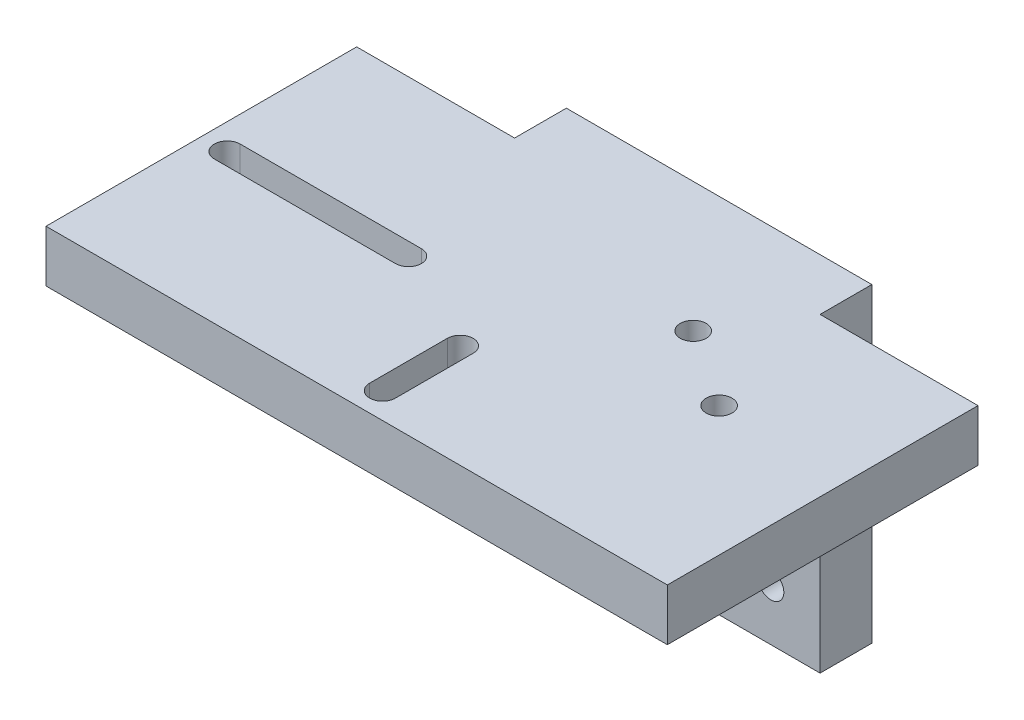
ISO-10303-21;
HEADER;
FILE_DESCRIPTION(('STEP AP214'),'2;1');
FILE_NAME('part.step','',(''),(''),'','','');
FILE_SCHEMA(('AUTOMOTIVE_DESIGN { 1 0 10303 214 1 1 1 1 }'));
ENDSEC;
DATA;
#1=APPLICATION_CONTEXT('core data for automotive mechanical design processes');
#2=APPLICATION_PROTOCOL_DEFINITION('international standard','automotive_design',2000,#1);
#3=PRODUCT_CONTEXT('',#1,'mechanical');
#4=PRODUCT('Part','Part','',(#3));
#5=PRODUCT_RELATED_PRODUCT_CATEGORY('part','',(#4));
#6=PRODUCT_DEFINITION_FORMATION('','',#4);
#7=PRODUCT_DEFINITION_CONTEXT('part definition',#1,'design');
#8=PRODUCT_DEFINITION('design','',#6,#7);
#9=PRODUCT_DEFINITION_SHAPE('','',#8);
#10=(LENGTH_UNIT() NAMED_UNIT(*) SI_UNIT(.MILLI.,.METRE.));
#11=(NAMED_UNIT(*) PLANE_ANGLE_UNIT() SI_UNIT($,.RADIAN.));
#12=(NAMED_UNIT(*) SI_UNIT($,.STERADIAN.) SOLID_ANGLE_UNIT());
#13=UNCERTAINTY_MEASURE_WITH_UNIT(LENGTH_MEASURE(1.E-05),#10,'distance_accuracy_value','');
#14=(GEOMETRIC_REPRESENTATION_CONTEXT(3) GLOBAL_UNCERTAINTY_ASSIGNED_CONTEXT((#13)) GLOBAL_UNIT_ASSIGNED_CONTEXT((#10,
#11,#12)) REPRESENTATION_CONTEXT('',''));
#15=CARTESIAN_POINT('',(0.,0.,0.));
#16=DIRECTION('',(0.,0.,1.));
#17=DIRECTION('',(1.,0.,0.));
#18=AXIS2_PLACEMENT_3D('',#15,#16,#17);
#19=CARTESIAN_POINT('',(0.,0.,10.));
#20=DIRECTION('',(0.,0.,1.));
#21=DIRECTION('',(1.,0.,0.));
#22=AXIS2_PLACEMENT_3D('',#19,#20,#21);
#23=PLANE('',#22);
#24=DIRECTION('',(0.,1.,0.));
#25=VECTOR('',#24,1.);
#26=CARTESIAN_POINT('',(-4.49999999999998,25.,10.));
#27=LINE('',#26,#25);
#28=CARTESIAN_POINT('',(-4.49999999999998,-5.,10.));
#29=VERTEX_POINT('',#28);
#30=CARTESIAN_POINT('',(-4.49999999999998,25.,10.));
#31=VERTEX_POINT('',#30);
#32=EDGE_CURVE('E209',#29,#31,#27,.T.);
#33=ORIENTED_EDGE('',*,*,#32,.F.);
#34=DIRECTION('',(-1.,0.,0.));
#35=VECTOR('',#34,1.);
#36=CARTESIAN_POINT('',(-4.49999999999998,-5.,10.));
#37=LINE('',#36,#35);
#38=CARTESIAN_POINT('',(-14.5,-5.,10.));
#39=VERTEX_POINT('',#38);
#40=EDGE_CURVE('E221',#29,#39,#37,.T.);
#41=ORIENTED_EDGE('',*,*,#40,.T.);
#42=DIRECTION('',(0.,1.,0.));
#43=VECTOR('',#42,1.);
#44=CARTESIAN_POINT('',(-14.5,25.,10.));
#45=LINE('',#44,#43);
#46=CARTESIAN_POINT('',(-14.5,25.,10.));
#47=VERTEX_POINT('',#46);
#48=EDGE_CURVE('E223',#39,#47,#45,.T.);
#49=ORIENTED_EDGE('',*,*,#48,.T.);
#50=DIRECTION('',(-1.,0.,0.));
#51=VECTOR('',#50,1.);
#52=CARTESIAN_POINT('',(-60.,25.,10.));
#53=LINE('',#52,#51);
#54=CARTESIAN_POINT('',(-29.5,25.,10.));
#55=VERTEX_POINT('',#54);
#56=EDGE_CURVE('E377',#47,#55,#53,.T.);
#57=ORIENTED_EDGE('',*,*,#56,.T.);
#58=DIRECTION('',(0.,-1.,0.));
#59=VECTOR('',#58,1.);
#60=CARTESIAN_POINT('',(-29.5,25.,10.));
#61=LINE('',#60,#59);
#62=CARTESIAN_POINT('',(-29.5,-25.,10.));
#63=VERTEX_POINT('',#62);
#64=EDGE_CURVE('E450',#55,#63,#61,.T.);
#65=ORIENTED_EDGE('',*,*,#64,.T.);
#66=DIRECTION('',(1.,0.,0.));
#67=VECTOR('',#66,1.);
#68=CARTESIAN_POINT('',(-29.5,-25.,10.));
#69=LINE('',#68,#67);
#70=CARTESIAN_POINT('',(29.5,-25.,10.));
#71=VERTEX_POINT('',#70);
#72=EDGE_CURVE('E456',#63,#71,#69,.T.);
#73=ORIENTED_EDGE('',*,*,#72,.T.);
#74=DIRECTION('',(0.,1.,0.));
#75=VECTOR('',#74,1.);
#76=CARTESIAN_POINT('',(29.5,35.,10.));
#77=LINE('',#76,#75);
#78=CARTESIAN_POINT('',(29.5,25.,10.));
#79=VERTEX_POINT('',#78);
#80=EDGE_CURVE('E446',#71,#79,#77,.T.);
#81=ORIENTED_EDGE('',*,*,#80,.T.);
#82=CARTESIAN_POINT('',(14.5,25.,10.));
#83=VERTEX_POINT('',#82);
#84=EDGE_CURVE('E11',#79,#83,#53,.T.);
#85=ORIENTED_EDGE('',*,*,#84,.T.);
#86=DIRECTION('',(0.,1.,0.));
#87=VECTOR('',#86,1.);
#88=CARTESIAN_POINT('',(14.5,25.,10.));
#89=LINE('',#88,#87);
#90=CARTESIAN_POINT('',(14.5,-5.,10.));
#91=VERTEX_POINT('',#90);
#92=EDGE_CURVE('E70',#91,#83,#89,.T.);
#93=ORIENTED_EDGE('',*,*,#92,.F.);
#94=DIRECTION('',(1.,0.,0.));
#95=VECTOR('',#94,1.);
#96=CARTESIAN_POINT('',(4.49999999999998,-5.,10.));
#97=LINE('',#96,#95);
#98=CARTESIAN_POINT('',(4.49999999999998,-5.,10.));
#99=VERTEX_POINT('',#98);
#100=EDGE_CURVE('E251',#99,#91,#97,.T.);
#101=ORIENTED_EDGE('',*,*,#100,.F.);
#102=DIRECTION('',(0.,1.,0.));
#103=VECTOR('',#102,1.);
#104=CARTESIAN_POINT('',(4.49999999999998,25.,10.));
#105=LINE('',#104,#103);
#106=CARTESIAN_POINT('',(4.49999999999998,25.,10.));
#107=VERTEX_POINT('',#106);
#108=EDGE_CURVE('E242',#99,#107,#105,.T.);
#109=ORIENTED_EDGE('',*,*,#108,.T.);
#110=EDGE_CURVE('E52',#107,#31,#53,.T.);
#111=ORIENTED_EDGE('',*,*,#110,.T.);
#112=EDGE_LOOP('',(#33,#41,#49,#57,#65,#73,#81,#85,#93,#101,#109,#111));
#113=FACE_BOUND('',#112,.T.);
#114=CARTESIAN_POINT('',(20.,-15.,10.));
#115=DIRECTION('',(0.,0.,1.));
#116=DIRECTION('',(1.,0.,0.));
#117=AXIS2_PLACEMENT_3D('',#114,#115,#116);
#118=CIRCLE('',#117,2.5);
#119=CARTESIAN_POINT('',(22.5,-15.,10.));
#120=VERTEX_POINT('',#119);
#121=EDGE_CURVE('E422',#120,#120,#118,.T.);
#122=ORIENTED_EDGE('',*,*,#121,.F.);
#123=EDGE_LOOP('',(#122));
#124=FACE_BOUND('',#123,.T.);
#125=CARTESIAN_POINT('',(-20.,15.,10.));
#126=DIRECTION('',(0.,0.,1.));
#127=DIRECTION('',(1.,0.,0.));
#128=AXIS2_PLACEMENT_3D('',#125,#126,#127);
#129=CIRCLE('',#128,2.5);
#130=CARTESIAN_POINT('',(-17.5,15.,10.));
#131=VERTEX_POINT('',#130);
#132=EDGE_CURVE('E438',#131,#131,#129,.T.);
#133=ORIENTED_EDGE('',*,*,#132,.F.);
#134=EDGE_LOOP('',(#133));
#135=FACE_BOUND('',#134,.T.);
#136=CARTESIAN_POINT('',(20.,15.,10.));
#137=DIRECTION('',(0.,0.,1.));
#138=DIRECTION('',(1.,0.,0.));
#139=AXIS2_PLACEMENT_3D('',#136,#137,#138);
#140=CIRCLE('',#139,2.5);
#141=CARTESIAN_POINT('',(22.5,15.,10.));
#142=VERTEX_POINT('',#141);
#143=EDGE_CURVE('E430',#142,#142,#140,.T.);
#144=ORIENTED_EDGE('',*,*,#143,.F.);
#145=EDGE_LOOP('',(#144));
#146=FACE_BOUND('',#145,.T.);
#147=CARTESIAN_POINT('',(-20.,-15.,10.));
#148=DIRECTION('',(0.,0.,1.));
#149=DIRECTION('',(1.,0.,0.));
#150=AXIS2_PLACEMENT_3D('',#147,#148,#149);
#151=CIRCLE('',#150,2.5);
#152=CARTESIAN_POINT('',(-17.5,-15.,10.));
#153=VERTEX_POINT('',#152);
#154=EDGE_CURVE('E414',#153,#153,#151,.T.);
#155=ORIENTED_EDGE('',*,*,#154,.F.);
#156=EDGE_LOOP('',(#155));
#157=FACE_BOUND('',#156,.T.);
#158=ADVANCED_FACE('F42',(#113,#124,#135,#146,#157),#23,.T.);
#159=CARTESIAN_POINT('',(0.,0.,0.));
#160=DIRECTION('',(0.,0.,1.));
#161=DIRECTION('',(1.,0.,0.));
#162=AXIS2_PLACEMENT_3D('',#159,#160,#161);
#163=PLANE('',#162);
#164=DIRECTION('',(-1.,0.,0.));
#165=VECTOR('',#164,1.);
#166=CARTESIAN_POINT('',(-29.5,35.,0.));
#167=LINE('',#166,#165);
#168=CARTESIAN_POINT('',(29.5,35.,0.));
#169=VERTEX_POINT('',#168);
#170=CARTESIAN_POINT('',(-29.5,35.,0.));
#171=VERTEX_POINT('',#170);
#172=EDGE_CURVE('E442',#169,#171,#167,.T.);
#173=ORIENTED_EDGE('',*,*,#172,.F.);
#174=DIRECTION('',(0.,1.,0.));
#175=VECTOR('',#174,1.);
#176=CARTESIAN_POINT('',(29.5,-25.,0.));
#177=LINE('',#176,#175);
#178=CARTESIAN_POINT('',(29.5,-25.,0.));
#179=VERTEX_POINT('',#178);
#180=EDGE_CURVE('E470',#179,#169,#177,.T.);
#181=ORIENTED_EDGE('',*,*,#180,.F.);
#182=DIRECTION('',(1.,0.,0.));
#183=VECTOR('',#182,1.);
#184=CARTESIAN_POINT('',(-29.5,-25.,0.));
#185=LINE('',#184,#183);
#186=CARTESIAN_POINT('',(-29.5,-25.,0.));
#187=VERTEX_POINT('',#186);
#188=EDGE_CURVE('E467',#187,#179,#185,.T.);
#189=ORIENTED_EDGE('',*,*,#188,.F.);
#190=DIRECTION('',(0.,-1.,0.));
#191=VECTOR('',#190,1.);
#192=CARTESIAN_POINT('',(-29.5,-25.,0.));
#193=LINE('',#192,#191);
#194=EDGE_CURVE('E464',#171,#187,#193,.T.);
#195=ORIENTED_EDGE('',*,*,#194,.F.);
#196=EDGE_LOOP('',(#173,#181,#189,#195));
#197=FACE_BOUND('',#196,.T.);
#198=CARTESIAN_POINT('',(-20.,15.,0.));
#199=DIRECTION('',(0.,0.,1.));
#200=DIRECTION('',(1.,0.,0.));
#201=AXIS2_PLACEMENT_3D('',#198,#199,#200);
#202=CIRCLE('',#201,2.5);
#203=CARTESIAN_POINT('',(-17.5,15.,0.));
#204=VERTEX_POINT('',#203);
#205=EDGE_CURVE('E434',#204,#204,#202,.T.);
#206=ORIENTED_EDGE('',*,*,#205,.T.);
#207=EDGE_LOOP('',(#206));
#208=FACE_BOUND('',#207,.T.);
#209=CARTESIAN_POINT('',(20.,15.,0.));
#210=DIRECTION('',(0.,0.,1.));
#211=DIRECTION('',(1.,0.,0.));
#212=AXIS2_PLACEMENT_3D('',#209,#210,#211);
#213=CIRCLE('',#212,2.5);
#214=CARTESIAN_POINT('',(22.5,15.,0.));
#215=VERTEX_POINT('',#214);
#216=EDGE_CURVE('E426',#215,#215,#213,.T.);
#217=ORIENTED_EDGE('',*,*,#216,.T.);
#218=EDGE_LOOP('',(#217));
#219=FACE_BOUND('',#218,.T.);
#220=CARTESIAN_POINT('',(20.,-15.,0.));
#221=DIRECTION('',(0.,0.,1.));
#222=DIRECTION('',(1.,0.,0.));
#223=AXIS2_PLACEMENT_3D('',#220,#221,#222);
#224=CIRCLE('',#223,2.5);
#225=CARTESIAN_POINT('',(22.5,-15.,0.));
#226=VERTEX_POINT('',#225);
#227=EDGE_CURVE('E418',#226,#226,#224,.T.);
#228=ORIENTED_EDGE('',*,*,#227,.T.);
#229=EDGE_LOOP('',(#228));
#230=FACE_BOUND('',#229,.T.);
#231=CARTESIAN_POINT('',(-20.,-15.,0.));
#232=DIRECTION('',(0.,0.,1.));
#233=DIRECTION('',(1.,0.,0.));
#234=AXIS2_PLACEMENT_3D('',#231,#232,#233);
#235=CIRCLE('',#234,2.5);
#236=CARTESIAN_POINT('',(-17.5,-15.,0.));
#237=VERTEX_POINT('',#236);
#238=EDGE_CURVE('E404',#237,#237,#235,.T.);
#239=ORIENTED_EDGE('',*,*,#238,.T.);
#240=EDGE_LOOP('',(#239));
#241=FACE_BOUND('',#240,.T.);
#242=ADVANCED_FACE('F528',(#197,#208,#219,#230,#241),#163,.F.);
#243=CARTESIAN_POINT('',(-29.5,35.,10.));
#244=DIRECTION('',(0.,-1.,0.));
#245=DIRECTION('',(0.,0.,-1.));
#246=AXIS2_PLACEMENT_3D('',#243,#244,#245);
#247=PLANE('',#246);
#248=ORIENTED_EDGE('',*,*,#172,.T.);
#249=DIRECTION('',(0.,0.,-1.));
#250=VECTOR('',#249,1.);
#251=CARTESIAN_POINT('',(-29.5,35.,10.));
#252=LINE('',#251,#250);
#253=CARTESIAN_POINT('',(-29.5,35.,10.));
#254=VERTEX_POINT('',#253);
#255=EDGE_CURVE('E479',#254,#171,#252,.T.);
#256=ORIENTED_EDGE('',*,*,#255,.F.);
#257=DIRECTION('',(-1.,0.,0.));
#258=VECTOR('',#257,1.);
#259=CARTESIAN_POINT('',(-60.,35.,10.));
#260=LINE('',#259,#258);
#261=CARTESIAN_POINT('',(-60.,35.,10.));
#262=VERTEX_POINT('',#261);
#263=EDGE_CURVE('E389',#254,#262,#260,.T.);
#264=ORIENTED_EDGE('',*,*,#263,.T.);
#265=DIRECTION('',(0.,0.,1.));
#266=VECTOR('',#265,1.);
#267=CARTESIAN_POINT('',(-60.,35.,70.));
#268=LINE('',#267,#266);
#269=CARTESIAN_POINT('',(-60.,35.,70.));
#270=VERTEX_POINT('',#269);
#271=EDGE_CURVE('E394',#262,#270,#268,.T.);
#272=ORIENTED_EDGE('',*,*,#271,.T.);
#273=DIRECTION('',(1.,0.,0.));
#274=VECTOR('',#273,1.);
#275=CARTESIAN_POINT('',(-60.,35.,70.));
#276=LINE('',#275,#274);
#277=CARTESIAN_POINT('',(60.,35.,70.));
#278=VERTEX_POINT('',#277);
#279=EDGE_CURVE('E372',#270,#278,#276,.T.);
#280=ORIENTED_EDGE('',*,*,#279,.T.);
#281=DIRECTION('',(0.,0.,-1.));
#282=VECTOR('',#281,1.);
#283=CARTESIAN_POINT('',(60.,35.,70.));
#284=LINE('',#283,#282);
#285=CARTESIAN_POINT('',(60.,35.,10.));
#286=VERTEX_POINT('',#285);
#287=EDGE_CURVE('E359',#278,#286,#284,.T.);
#288=ORIENTED_EDGE('',*,*,#287,.T.);
#289=CARTESIAN_POINT('',(29.5,35.,10.));
#290=VERTEX_POINT('',#289);
#291=EDGE_CURVE('E390',#286,#290,#260,.T.);
#292=ORIENTED_EDGE('',*,*,#291,.T.);
#293=DIRECTION('',(0.,0.,-1.));
#294=VECTOR('',#293,1.);
#295=CARTESIAN_POINT('',(29.5,35.,10.));
#296=LINE('',#295,#294);
#297=EDGE_CURVE('E46',#290,#169,#296,.T.);
#298=ORIENTED_EDGE('',*,*,#297,.T.);
#299=EDGE_LOOP('',(#248,#256,#264,#272,#280,#288,#292,#298));
#300=FACE_BOUND('',#299,.T.);
#301=DIRECTION('',(-1.,0.,0.));
#302=VECTOR('',#301,1.);
#303=CARTESIAN_POINT('',(-55.,35.,37.5));
#304=LINE('',#303,#302);
#305=CARTESIAN_POINT('',(-20.,35.,37.5));
#306=VERTEX_POINT('',#305);
#307=CARTESIAN_POINT('',(-55.,35.,37.5));
#308=VERTEX_POINT('',#307);
#309=EDGE_CURVE('E285',#306,#308,#304,.T.);
#310=ORIENTED_EDGE('',*,*,#309,.F.);
#311=CARTESIAN_POINT('',(-20.,35.,40.));
#312=DIRECTION('',(0.,1.,0.));
#313=DIRECTION('',(0.,0.,-1.));
#314=AXIS2_PLACEMENT_3D('',#311,#312,#313);
#315=CIRCLE('',#314,2.5);
#316=CARTESIAN_POINT('',(-20.,35.,42.5));
#317=VERTEX_POINT('',#316);
#318=EDGE_CURVE('E262',#317,#306,#315,.T.);
#319=ORIENTED_EDGE('',*,*,#318,.F.);
#320=DIRECTION('',(1.,0.,0.));
#321=VECTOR('',#320,1.);
#322=CARTESIAN_POINT('',(-55.,35.,42.5));
#323=LINE('',#322,#321);
#324=CARTESIAN_POINT('',(-55.,35.,42.5));
#325=VERTEX_POINT('',#324);
#326=EDGE_CURVE('E270',#325,#317,#323,.T.);
#327=ORIENTED_EDGE('',*,*,#326,.F.);
#328=CARTESIAN_POINT('',(-55.,35.,40.));
#329=DIRECTION('',(0.,1.,0.));
#330=DIRECTION('',(0.,0.,-1.));
#331=AXIS2_PLACEMENT_3D('',#328,#329,#330);
#332=CIRCLE('',#331,2.5);
#333=EDGE_CURVE('E289',#308,#325,#332,.T.);
#334=ORIENTED_EDGE('',*,*,#333,.F.);
#335=EDGE_LOOP('',(#310,#319,#327,#334));
#336=FACE_BOUND('',#335,.T.);
#337=CARTESIAN_POINT('',(35.,35.,35.));
#338=DIRECTION('',(0.,1.,0.));
#339=DIRECTION('',(0.,0.,1.));
#340=AXIS2_PLACEMENT_3D('',#337,#338,#339);
#341=CIRCLE('',#340,2.5);
#342=CARTESIAN_POINT('',(35.,35.,37.5));
#343=VERTEX_POINT('',#342);
#344=EDGE_CURVE('E299',#343,#343,#341,.T.);
#345=ORIENTED_EDGE('',*,*,#344,.F.);
#346=EDGE_LOOP('',(#345));
#347=FACE_BOUND('',#346,.T.);
#348=CARTESIAN_POINT('',(20.,35.,25.));
#349=DIRECTION('',(0.,1.,0.));
#350=DIRECTION('',(0.,0.,1.));
#351=AXIS2_PLACEMENT_3D('',#348,#349,#350);
#352=CIRCLE('',#351,2.5);
#353=CARTESIAN_POINT('',(20.,35.,27.5));
#354=VERTEX_POINT('',#353);
#355=EDGE_CURVE('E313',#354,#354,#352,.T.);
#356=ORIENTED_EDGE('',*,*,#355,.F.);
#357=EDGE_LOOP('',(#356));
#358=FACE_BOUND('',#357,.T.);
#359=DIRECTION('',(0.,0.,-1.));
#360=VECTOR('',#359,1.);
#361=CARTESIAN_POINT('',(2.5,35.,65.));
#362=LINE('',#361,#360);
#363=CARTESIAN_POINT('',(2.5,35.,65.));
#364=VERTEX_POINT('',#363);
#365=CARTESIAN_POINT('',(2.5,35.,50.));
#366=VERTEX_POINT('',#365);
#367=EDGE_CURVE('E345',#364,#366,#362,.T.);
#368=ORIENTED_EDGE('',*,*,#367,.F.);
#369=CARTESIAN_POINT('',(0.,35.,65.));
#370=DIRECTION('',(0.,1.,0.));
#371=DIRECTION('',(0.,0.,-1.));
#372=AXIS2_PLACEMENT_3D('',#369,#370,#371);
#373=CIRCLE('',#372,2.5);
#374=CARTESIAN_POINT('',(-2.5,35.,65.));
#375=VERTEX_POINT('',#374);
#376=EDGE_CURVE('E321',#375,#364,#373,.T.);
#377=ORIENTED_EDGE('',*,*,#376,.F.);
#378=DIRECTION('',(0.,0.,1.));
#379=VECTOR('',#378,1.);
#380=CARTESIAN_POINT('',(-2.5,35.,65.));
#381=LINE('',#380,#379);
#382=CARTESIAN_POINT('',(-2.5,35.,50.));
#383=VERTEX_POINT('',#382);
#384=EDGE_CURVE('E330',#383,#375,#381,.T.);
#385=ORIENTED_EDGE('',*,*,#384,.F.);
#386=CARTESIAN_POINT('',(0.,35.,50.));
#387=DIRECTION('',(0.,1.,0.));
#388=DIRECTION('',(0.,0.,-1.));
#389=AXIS2_PLACEMENT_3D('',#386,#387,#388);
#390=CIRCLE('',#389,2.5);
#391=EDGE_CURVE('E349',#366,#383,#390,.T.);
#392=ORIENTED_EDGE('',*,*,#391,.F.);
#393=EDGE_LOOP('',(#368,#377,#385,#392));
#394=FACE_BOUND('',#393,.T.);
#395=ADVANCED_FACE('F44',(#300,#336,#347,#358,#394),#247,.F.);
#396=CARTESIAN_POINT('',(-29.5,-25.,10.));
#397=DIRECTION('',(1.,0.,0.));
#398=DIRECTION('',(0.,0.,-1.));
#399=AXIS2_PLACEMENT_3D('',#396,#397,#398);
#400=PLANE('',#399);
#401=ORIENTED_EDGE('',*,*,#194,.T.);
#402=DIRECTION('',(0.,0.,-1.));
#403=VECTOR('',#402,1.);
#404=CARTESIAN_POINT('',(-29.5,-25.,10.));
#405=LINE('',#404,#403);
#406=EDGE_CURVE('E476',#63,#187,#405,.T.);
#407=ORIENTED_EDGE('',*,*,#406,.F.);
#408=ORIENTED_EDGE('',*,*,#64,.F.);
#409=EDGE_CURVE('E452',#254,#55,#61,.T.);
#410=ORIENTED_EDGE('',*,*,#409,.F.);
#411=ORIENTED_EDGE('',*,*,#255,.T.);
#412=EDGE_LOOP('',(#401,#407,#408,#410,#411));
#413=FACE_BOUND('',#412,.T.);
#414=ADVANCED_FACE('F513',(#413),#400,.F.);
#415=CARTESIAN_POINT('',(-29.5,-25.,10.));
#416=DIRECTION('',(0.,1.,0.));
#417=DIRECTION('',(0.,0.,1.));
#418=AXIS2_PLACEMENT_3D('',#415,#416,#417);
#419=PLANE('',#418);
#420=ORIENTED_EDGE('',*,*,#188,.T.);
#421=DIRECTION('',(0.,0.,-1.));
#422=VECTOR('',#421,1.);
#423=CARTESIAN_POINT('',(29.5,-25.,10.));
#424=LINE('',#423,#422);
#425=EDGE_CURVE('E460',#71,#179,#424,.T.);
#426=ORIENTED_EDGE('',*,*,#425,.F.);
#427=ORIENTED_EDGE('',*,*,#72,.F.);
#428=ORIENTED_EDGE('',*,*,#406,.T.);
#429=EDGE_LOOP('',(#420,#426,#427,#428));
#430=FACE_BOUND('',#429,.T.);
#431=ADVANCED_FACE('F531',(#430),#419,.F.);
#432=CARTESIAN_POINT('',(29.5,-25.,10.));
#433=DIRECTION('',(-1.,0.,0.));
#434=DIRECTION('',(0.,0.,1.));
#435=AXIS2_PLACEMENT_3D('',#432,#433,#434);
#436=PLANE('',#435);
#437=ORIENTED_EDGE('',*,*,#180,.T.);
#438=ORIENTED_EDGE('',*,*,#297,.F.);
#439=EDGE_CURVE('E451',#79,#290,#77,.T.);
#440=ORIENTED_EDGE('',*,*,#439,.F.);
#441=ORIENTED_EDGE('',*,*,#80,.F.);
#442=ORIENTED_EDGE('',*,*,#425,.T.);
#443=EDGE_LOOP('',(#437,#438,#440,#441,#442));
#444=FACE_BOUND('',#443,.T.);
#445=ADVANCED_FACE('F523',(#444),#436,.F.);
#446=CARTESIAN_POINT('',(-20.,15.,10.));
#447=DIRECTION('',(0.,0.,-1.));
#448=DIRECTION('',(-1.,0.,0.));
#449=AXIS2_PLACEMENT_3D('',#446,#447,#448);
#450=CYLINDRICAL_SURFACE('',#449,2.5);
#451=ORIENTED_EDGE('',*,*,#132,.T.);
#452=EDGE_LOOP('',(#451));
#453=FACE_BOUND('',#452,.T.);
#454=ORIENTED_EDGE('',*,*,#205,.F.);
#455=EDGE_LOOP('',(#454));
#456=FACE_BOUND('',#455,.T.);
#457=ADVANCED_FACE('F557',(#453,#456),#450,.F.);
#458=CARTESIAN_POINT('',(20.,15.,10.));
#459=DIRECTION('',(0.,0.,-1.));
#460=DIRECTION('',(-1.,0.,0.));
#461=AXIS2_PLACEMENT_3D('',#458,#459,#460);
#462=CYLINDRICAL_SURFACE('',#461,2.5);
#463=ORIENTED_EDGE('',*,*,#143,.T.);
#464=EDGE_LOOP('',(#463));
#465=FACE_BOUND('',#464,.T.);
#466=ORIENTED_EDGE('',*,*,#216,.F.);
#467=EDGE_LOOP('',(#466));
#468=FACE_BOUND('',#467,.T.);
#469=ADVANCED_FACE('F594',(#465,#468),#462,.F.);
#470=CARTESIAN_POINT('',(20.,-15.,10.));
#471=DIRECTION('',(0.,0.,-1.));
#472=DIRECTION('',(-1.,0.,0.));
#473=AXIS2_PLACEMENT_3D('',#470,#471,#472);
#474=CYLINDRICAL_SURFACE('',#473,2.5);
#475=ORIENTED_EDGE('',*,*,#121,.T.);
#476=EDGE_LOOP('',(#475));
#477=FACE_BOUND('',#476,.T.);
#478=ORIENTED_EDGE('',*,*,#227,.F.);
#479=EDGE_LOOP('',(#478));
#480=FACE_BOUND('',#479,.T.);
#481=ADVANCED_FACE('F605',(#477,#480),#474,.F.);
#482=CARTESIAN_POINT('',(-20.,-15.,10.));
#483=DIRECTION('',(0.,0.,-1.));
#484=DIRECTION('',(-1.,0.,0.));
#485=AXIS2_PLACEMENT_3D('',#482,#483,#484);
#486=CYLINDRICAL_SURFACE('',#485,2.5);
#487=ORIENTED_EDGE('',*,*,#154,.T.);
#488=EDGE_LOOP('',(#487));
#489=FACE_BOUND('',#488,.T.);
#490=ORIENTED_EDGE('',*,*,#238,.F.);
#491=EDGE_LOOP('',(#490));
#492=FACE_BOUND('',#491,.T.);
#493=ADVANCED_FACE('F614',(#489,#492),#486,.F.);
#494=CARTESIAN_POINT('',(-60.,25.,10.));
#495=DIRECTION('',(0.,0.,-1.));
#496=DIRECTION('',(-1.,0.,0.));
#497=AXIS2_PLACEMENT_3D('',#494,#495,#496);
#498=PLANE('',#497);
#499=CARTESIAN_POINT('',(60.,25.,10.));
#500=VERTEX_POINT('',#499);
#501=EDGE_CURVE('E54',#500,#79,#53,.T.);
#502=ORIENTED_EDGE('',*,*,#501,.T.);
#503=ORIENTED_EDGE('',*,*,#439,.T.);
#504=ORIENTED_EDGE('',*,*,#291,.F.);
#505=DIRECTION('',(0.,1.,0.));
#506=VECTOR('',#505,1.);
#507=CARTESIAN_POINT('',(60.,25.,10.));
#508=LINE('',#507,#506);
#509=EDGE_CURVE('E385',#500,#286,#508,.T.);
#510=ORIENTED_EDGE('',*,*,#509,.F.);
#511=EDGE_LOOP('',(#502,#503,#504,#510));
#512=FACE_BOUND('',#511,.T.);
#513=ADVANCED_FACE('F521',(#512),#498,.T.);
#514=CARTESIAN_POINT('',(60.,25.,70.));
#515=DIRECTION('',(1.,0.,0.));
#516=DIRECTION('',(0.,0.,-1.));
#517=AXIS2_PLACEMENT_3D('',#514,#515,#516);
#518=PLANE('',#517);
#519=ORIENTED_EDGE('',*,*,#287,.F.);
#520=DIRECTION('',(0.,1.,0.));
#521=VECTOR('',#520,1.);
#522=CARTESIAN_POINT('',(60.,25.,70.));
#523=LINE('',#522,#521);
#524=CARTESIAN_POINT('',(60.,25.,70.));
#525=VERTEX_POINT('',#524);
#526=EDGE_CURVE('E401',#525,#278,#523,.T.);
#527=ORIENTED_EDGE('',*,*,#526,.F.);
#528=DIRECTION('',(0.,0.,-1.));
#529=VECTOR('',#528,1.);
#530=CARTESIAN_POINT('',(60.,25.,70.));
#531=LINE('',#530,#529);
#532=EDGE_CURVE('E369',#525,#500,#531,.T.);
#533=ORIENTED_EDGE('',*,*,#532,.T.);
#534=ORIENTED_EDGE('',*,*,#509,.T.);
#535=EDGE_LOOP('',(#519,#527,#533,#534));
#536=FACE_BOUND('',#535,.T.);
#537=ADVANCED_FACE('F635',(#536),#518,.T.);
#538=CARTESIAN_POINT('',(-60.,25.,70.));
#539=DIRECTION('',(0.,0.,1.));
#540=DIRECTION('',(1.,0.,0.));
#541=AXIS2_PLACEMENT_3D('',#538,#539,#540);
#542=PLANE('',#541);
#543=ORIENTED_EDGE('',*,*,#279,.F.);
#544=DIRECTION('',(0.,1.,0.));
#545=VECTOR('',#544,1.);
#546=CARTESIAN_POINT('',(-60.,25.,70.));
#547=LINE('',#546,#545);
#548=CARTESIAN_POINT('',(-60.,25.,70.));
#549=VERTEX_POINT('',#548);
#550=EDGE_CURVE('E405',#549,#270,#547,.T.);
#551=ORIENTED_EDGE('',*,*,#550,.F.);
#552=DIRECTION('',(1.,0.,0.));
#553=VECTOR('',#552,1.);
#554=CARTESIAN_POINT('',(-60.,25.,70.));
#555=LINE('',#554,#553);
#556=EDGE_CURVE('E381',#549,#525,#555,.T.);
#557=ORIENTED_EDGE('',*,*,#556,.T.);
#558=ORIENTED_EDGE('',*,*,#526,.T.);
#559=EDGE_LOOP('',(#543,#551,#557,#558));
#560=FACE_BOUND('',#559,.T.);
#561=ADVANCED_FACE('F508',(#560),#542,.T.);
#562=CARTESIAN_POINT('',(-60.,25.,70.));
#563=DIRECTION('',(-1.,0.,0.));
#564=DIRECTION('',(0.,0.,1.));
#565=AXIS2_PLACEMENT_3D('',#562,#563,#564);
#566=PLANE('',#565);
#567=ORIENTED_EDGE('',*,*,#271,.F.);
#568=DIRECTION('',(0.,1.,0.));
#569=VECTOR('',#568,1.);
#570=CARTESIAN_POINT('',(-60.,25.,10.));
#571=LINE('',#570,#569);
#572=CARTESIAN_POINT('',(-60.,25.,10.));
#573=VERTEX_POINT('',#572);
#574=EDGE_CURVE('E408',#573,#262,#571,.T.);
#575=ORIENTED_EDGE('',*,*,#574,.F.);
#576=DIRECTION('',(0.,0.,1.));
#577=VECTOR('',#576,1.);
#578=CARTESIAN_POINT('',(-60.,25.,70.));
#579=LINE('',#578,#577);
#580=EDGE_CURVE('E376',#573,#549,#579,.T.);
#581=ORIENTED_EDGE('',*,*,#580,.T.);
#582=ORIENTED_EDGE('',*,*,#550,.T.);
#583=EDGE_LOOP('',(#567,#575,#581,#582));
#584=FACE_BOUND('',#583,.T.);
#585=ADVANCED_FACE('F502',(#584),#566,.T.);
#586=ORIENTED_EDGE('',*,*,#263,.F.);
#587=ORIENTED_EDGE('',*,*,#409,.T.);
#588=EDGE_CURVE('E55',#55,#573,#53,.T.);
#589=ORIENTED_EDGE('',*,*,#588,.T.);
#590=ORIENTED_EDGE('',*,*,#574,.T.);
#591=EDGE_LOOP('',(#586,#587,#589,#590));
#592=FACE_BOUND('',#591,.T.);
#593=ADVANCED_FACE('F497',(#592),#498,.T.);
#594=CARTESIAN_POINT('',(0.,25.,0.));
#595=DIRECTION('',(0.,-1.,0.));
#596=DIRECTION('',(0.,0.,-1.));
#597=AXIS2_PLACEMENT_3D('',#594,#595,#596);
#598=PLANE('',#597);
#599=DIRECTION('',(0.,0.,1.));
#600=VECTOR('',#599,1.);
#601=CARTESIAN_POINT('',(-4.49999999999998,25.,40.0000000000001));
#602=LINE('',#601,#600);
#603=CARTESIAN_POINT('',(-4.49999999999998,25.,40.0000000000001));
#604=VERTEX_POINT('',#603);
#605=EDGE_CURVE('E203',#31,#604,#602,.T.);
#606=ORIENTED_EDGE('',*,*,#605,.F.);
#607=ORIENTED_EDGE('',*,*,#110,.F.);
#608=DIRECTION('',(0.,0.,1.));
#609=VECTOR('',#608,1.);
#610=CARTESIAN_POINT('',(4.49999999999998,25.,40.0000000000001));
#611=LINE('',#610,#609);
#612=CARTESIAN_POINT('',(4.49999999999998,25.,40.0000000000001));
#613=VERTEX_POINT('',#612);
#614=EDGE_CURVE('E247',#107,#613,#611,.T.);
#615=ORIENTED_EDGE('',*,*,#614,.T.);
#616=DIRECTION('',(1.,0.,0.));
#617=VECTOR('',#616,1.);
#618=CARTESIAN_POINT('',(4.49999999999998,25.,40.0000000000001));
#619=LINE('',#618,#617);
#620=CARTESIAN_POINT('',(14.5,25.,40.0000000000001));
#621=VERTEX_POINT('',#620);
#622=EDGE_CURVE('E258',#613,#621,#619,.T.);
#623=ORIENTED_EDGE('',*,*,#622,.T.);
#624=DIRECTION('',(0.,0.,1.));
#625=VECTOR('',#624,1.);
#626=CARTESIAN_POINT('',(14.5,25.,40.0000000000001));
#627=LINE('',#626,#625);
#628=EDGE_CURVE('E243',#83,#621,#627,.T.);
#629=ORIENTED_EDGE('',*,*,#628,.F.);
#630=ORIENTED_EDGE('',*,*,#84,.F.);
#631=ORIENTED_EDGE('',*,*,#501,.F.);
#632=ORIENTED_EDGE('',*,*,#532,.F.);
#633=ORIENTED_EDGE('',*,*,#556,.F.);
#634=ORIENTED_EDGE('',*,*,#580,.F.);
#635=ORIENTED_EDGE('',*,*,#588,.F.);
#636=ORIENTED_EDGE('',*,*,#56,.F.);
#637=DIRECTION('',(0.,0.,1.));
#638=VECTOR('',#637,1.);
#639=CARTESIAN_POINT('',(-14.5,25.,40.0000000000001));
#640=LINE('',#639,#638);
#641=CARTESIAN_POINT('',(-14.5,25.,40.0000000000001));
#642=VERTEX_POINT('',#641);
#643=EDGE_CURVE('E228',#47,#642,#640,.T.);
#644=ORIENTED_EDGE('',*,*,#643,.T.);
#645=DIRECTION('',(-1.,0.,0.));
#646=VECTOR('',#645,1.);
#647=CARTESIAN_POINT('',(-4.49999999999998,25.,40.0000000000001));
#648=LINE('',#647,#646);
#649=EDGE_CURVE('E218',#604,#642,#648,.T.);
#650=ORIENTED_EDGE('',*,*,#649,.F.);
#651=EDGE_LOOP('',(#606,#607,#615,#623,#629,#630,#631,#632,#633,#634,#635,#636,#644,#650));
#652=FACE_BOUND('',#651,.T.);
#653=CARTESIAN_POINT('',(-20.,25.,40.));
#654=DIRECTION('',(0.,1.,0.));
#655=DIRECTION('',(0.,0.,-1.));
#656=AXIS2_PLACEMENT_3D('',#653,#654,#655);
#657=CIRCLE('',#656,2.5);
#658=CARTESIAN_POINT('',(-20.,25.,42.5));
#659=VERTEX_POINT('',#658);
#660=CARTESIAN_POINT('',(-20.,25.,37.5));
#661=VERTEX_POINT('',#660);
#662=EDGE_CURVE('E265',#659,#661,#657,.T.);
#663=ORIENTED_EDGE('',*,*,#662,.T.);
#664=DIRECTION('',(-1.,0.,0.));
#665=VECTOR('',#664,1.);
#666=CARTESIAN_POINT('',(-55.,25.,37.5));
#667=LINE('',#666,#665);
#668=CARTESIAN_POINT('',(-55.,25.,37.5));
#669=VERTEX_POINT('',#668);
#670=EDGE_CURVE('E269',#661,#669,#667,.T.);
#671=ORIENTED_EDGE('',*,*,#670,.T.);
#672=CARTESIAN_POINT('',(-55.,25.,40.));
#673=DIRECTION('',(0.,1.,0.));
#674=DIRECTION('',(0.,0.,-1.));
#675=AXIS2_PLACEMENT_3D('',#672,#673,#674);
#676=CIRCLE('',#675,2.5);
#677=CARTESIAN_POINT('',(-55.,25.,42.5));
#678=VERTEX_POINT('',#677);
#679=EDGE_CURVE('E274',#669,#678,#676,.T.);
#680=ORIENTED_EDGE('',*,*,#679,.T.);
#681=DIRECTION('',(1.,0.,0.));
#682=VECTOR('',#681,1.);
#683=CARTESIAN_POINT('',(-55.,25.,42.5));
#684=LINE('',#683,#682);
#685=EDGE_CURVE('E278',#678,#659,#684,.T.);
#686=ORIENTED_EDGE('',*,*,#685,.T.);
#687=EDGE_LOOP('',(#663,#671,#680,#686));
#688=FACE_BOUND('',#687,.T.);
#689=CARTESIAN_POINT('',(35.,25.,35.));
#690=DIRECTION('',(0.,1.,0.));
#691=DIRECTION('',(0.,0.,1.));
#692=AXIS2_PLACEMENT_3D('',#689,#690,#691);
#693=CIRCLE('',#692,2.5);
#694=CARTESIAN_POINT('',(35.,25.,37.5));
#695=VERTEX_POINT('',#694);
#696=EDGE_CURVE('E309',#695,#695,#693,.T.);
#697=ORIENTED_EDGE('',*,*,#696,.T.);
#698=EDGE_LOOP('',(#697));
#699=FACE_BOUND('',#698,.T.);
#700=CARTESIAN_POINT('',(20.,25.,25.));
#701=DIRECTION('',(0.,1.,0.));
#702=DIRECTION('',(0.,0.,1.));
#703=AXIS2_PLACEMENT_3D('',#700,#701,#702);
#704=CIRCLE('',#703,2.5);
#705=CARTESIAN_POINT('',(20.,25.,27.5));
#706=VERTEX_POINT('',#705);
#707=EDGE_CURVE('E317',#706,#706,#704,.T.);
#708=ORIENTED_EDGE('',*,*,#707,.T.);
#709=EDGE_LOOP('',(#708));
#710=FACE_BOUND('',#709,.T.);
#711=CARTESIAN_POINT('',(0.,25.,65.));
#712=DIRECTION('',(0.,1.,0.));
#713=DIRECTION('',(0.,0.,-1.));
#714=AXIS2_PLACEMENT_3D('',#711,#712,#713);
#715=CIRCLE('',#714,2.5);
#716=CARTESIAN_POINT('',(-2.5,25.,65.));
#717=VERTEX_POINT('',#716);
#718=CARTESIAN_POINT('',(2.5,25.,65.));
#719=VERTEX_POINT('',#718);
#720=EDGE_CURVE('E325',#717,#719,#715,.T.);
#721=ORIENTED_EDGE('',*,*,#720,.T.);
#722=DIRECTION('',(0.,0.,-1.));
#723=VECTOR('',#722,1.);
#724=CARTESIAN_POINT('',(2.5,25.,65.));
#725=LINE('',#724,#723);
#726=CARTESIAN_POINT('',(2.5,25.,50.));
#727=VERTEX_POINT('',#726);
#728=EDGE_CURVE('E329',#719,#727,#725,.T.);
#729=ORIENTED_EDGE('',*,*,#728,.T.);
#730=CARTESIAN_POINT('',(0.,25.,50.));
#731=DIRECTION('',(0.,1.,0.));
#732=DIRECTION('',(0.,0.,-1.));
#733=AXIS2_PLACEMENT_3D('',#730,#731,#732);
#734=CIRCLE('',#733,2.5);
#735=CARTESIAN_POINT('',(-2.5,25.,50.));
#736=VERTEX_POINT('',#735);
#737=EDGE_CURVE('E334',#727,#736,#734,.T.);
#738=ORIENTED_EDGE('',*,*,#737,.T.);
#739=DIRECTION('',(0.,0.,1.));
#740=VECTOR('',#739,1.);
#741=CARTESIAN_POINT('',(-2.5,25.,65.));
#742=LINE('',#741,#740);
#743=EDGE_CURVE('E338',#736,#717,#742,.T.);
#744=ORIENTED_EDGE('',*,*,#743,.T.);
#745=EDGE_LOOP('',(#721,#729,#738,#744));
#746=FACE_BOUND('',#745,.T.);
#747=ADVANCED_FACE('F225',(#652,#688,#699,#710,#746),#598,.T.);
#748=CARTESIAN_POINT('',(0.,25.,65.));
#749=DIRECTION('',(0.,1.,0.));
#750=DIRECTION('',(0.,0.,1.));
#751=AXIS2_PLACEMENT_3D('',#748,#749,#750);
#752=CYLINDRICAL_SURFACE('',#751,2.5);
#753=ORIENTED_EDGE('',*,*,#376,.T.);
#754=DIRECTION('',(0.,1.,0.));
#755=VECTOR('',#754,1.);
#756=CARTESIAN_POINT('',(2.5,25.,65.));
#757=LINE('',#756,#755);
#758=EDGE_CURVE('E342',#719,#364,#757,.T.);
#759=ORIENTED_EDGE('',*,*,#758,.F.);
#760=ORIENTED_EDGE('',*,*,#720,.F.);
#761=DIRECTION('',(0.,1.,0.));
#762=VECTOR('',#761,1.);
#763=CARTESIAN_POINT('',(-2.5,25.,65.));
#764=LINE('',#763,#762);
#765=EDGE_CURVE('E356',#717,#375,#764,.T.);
#766=ORIENTED_EDGE('',*,*,#765,.T.);
#767=EDGE_LOOP('',(#753,#759,#760,#766));
#768=FACE_BOUND('',#767,.T.);
#769=ADVANCED_FACE('F668',(#768),#752,.F.);
#770=CARTESIAN_POINT('',(-2.5,25.,65.));
#771=DIRECTION('',(-1.,0.,0.));
#772=DIRECTION('',(0.,0.,1.));
#773=AXIS2_PLACEMENT_3D('',#770,#771,#772);
#774=PLANE('',#773);
#775=ORIENTED_EDGE('',*,*,#384,.T.);
#776=ORIENTED_EDGE('',*,*,#765,.F.);
#777=ORIENTED_EDGE('',*,*,#743,.F.);
#778=DIRECTION('',(0.,1.,0.));
#779=VECTOR('',#778,1.);
#780=CARTESIAN_POINT('',(-2.5,25.,50.));
#781=LINE('',#780,#779);
#782=EDGE_CURVE('E360',#736,#383,#781,.T.);
#783=ORIENTED_EDGE('',*,*,#782,.T.);
#784=EDGE_LOOP('',(#775,#776,#777,#783));
#785=FACE_BOUND('',#784,.T.);
#786=ADVANCED_FACE('F675',(#785),#774,.F.);
#787=CARTESIAN_POINT('',(0.,25.,50.));
#788=DIRECTION('',(0.,1.,0.));
#789=DIRECTION('',(0.,0.,1.));
#790=AXIS2_PLACEMENT_3D('',#787,#788,#789);
#791=CYLINDRICAL_SURFACE('',#790,2.5);
#792=ORIENTED_EDGE('',*,*,#391,.T.);
#793=ORIENTED_EDGE('',*,*,#782,.F.);
#794=ORIENTED_EDGE('',*,*,#737,.F.);
#795=DIRECTION('',(0.,1.,0.));
#796=VECTOR('',#795,1.);
#797=CARTESIAN_POINT('',(2.5,25.,50.));
#798=LINE('',#797,#796);
#799=EDGE_CURVE('E363',#727,#366,#798,.T.);
#800=ORIENTED_EDGE('',*,*,#799,.T.);
#801=EDGE_LOOP('',(#792,#793,#794,#800));
#802=FACE_BOUND('',#801,.T.);
#803=ADVANCED_FACE('F683',(#802),#791,.F.);
#804=CARTESIAN_POINT('',(2.5,25.,65.));
#805=DIRECTION('',(1.,0.,0.));
#806=DIRECTION('',(0.,0.,-1.));
#807=AXIS2_PLACEMENT_3D('',#804,#805,#806);
#808=PLANE('',#807);
#809=ORIENTED_EDGE('',*,*,#367,.T.);
#810=ORIENTED_EDGE('',*,*,#799,.F.);
#811=ORIENTED_EDGE('',*,*,#728,.F.);
#812=ORIENTED_EDGE('',*,*,#758,.T.);
#813=EDGE_LOOP('',(#809,#810,#811,#812));
#814=FACE_BOUND('',#813,.T.);
#815=ADVANCED_FACE('F691',(#814),#808,.F.);
#816=CARTESIAN_POINT('',(20.,25.,25.));
#817=DIRECTION('',(0.,1.,0.));
#818=DIRECTION('',(0.,0.,1.));
#819=AXIS2_PLACEMENT_3D('',#816,#817,#818);
#820=CYLINDRICAL_SURFACE('',#819,2.5);
#821=ORIENTED_EDGE('',*,*,#707,.F.);
#822=EDGE_LOOP('',(#821));
#823=FACE_BOUND('',#822,.T.);
#824=ORIENTED_EDGE('',*,*,#355,.T.);
#825=EDGE_LOOP('',(#824));
#826=FACE_BOUND('',#825,.T.);
#827=ADVANCED_FACE('F699',(#823,#826),#820,.F.);
#828=CARTESIAN_POINT('',(35.,25.,35.));
#829=DIRECTION('',(0.,1.,0.));
#830=DIRECTION('',(0.,0.,1.));
#831=AXIS2_PLACEMENT_3D('',#828,#829,#830);
#832=CYLINDRICAL_SURFACE('',#831,2.5);
#833=ORIENTED_EDGE('',*,*,#696,.F.);
#834=EDGE_LOOP('',(#833));
#835=FACE_BOUND('',#834,.T.);
#836=ORIENTED_EDGE('',*,*,#344,.T.);
#837=EDGE_LOOP('',(#836));
#838=FACE_BOUND('',#837,.T.);
#839=ADVANCED_FACE('F707',(#835,#838),#832,.F.);
#840=CARTESIAN_POINT('',(-20.,25.,40.));
#841=DIRECTION('',(0.,1.,0.));
#842=DIRECTION('',(0.,0.,1.));
#843=AXIS2_PLACEMENT_3D('',#840,#841,#842);
#844=CYLINDRICAL_SURFACE('',#843,2.5);
#845=ORIENTED_EDGE('',*,*,#318,.T.);
#846=DIRECTION('',(0.,1.,0.));
#847=VECTOR('',#846,1.);
#848=CARTESIAN_POINT('',(-20.,25.,37.5));
#849=LINE('',#848,#847);
#850=EDGE_CURVE('E282',#661,#306,#849,.T.);
#851=ORIENTED_EDGE('',*,*,#850,.F.);
#852=ORIENTED_EDGE('',*,*,#662,.F.);
#853=DIRECTION('',(0.,1.,0.));
#854=VECTOR('',#853,1.);
#855=CARTESIAN_POINT('',(-20.,25.,42.5));
#856=LINE('',#855,#854);
#857=EDGE_CURVE('E296',#659,#317,#856,.T.);
#858=ORIENTED_EDGE('',*,*,#857,.T.);
#859=EDGE_LOOP('',(#845,#851,#852,#858));
#860=FACE_BOUND('',#859,.T.);
#861=ADVANCED_FACE('F715',(#860),#844,.F.);
#862=CARTESIAN_POINT('',(-55.,25.,42.5));
#863=DIRECTION('',(0.,0.,1.));
#864=DIRECTION('',(1.,0.,0.));
#865=AXIS2_PLACEMENT_3D('',#862,#863,#864);
#866=PLANE('',#865);
#867=ORIENTED_EDGE('',*,*,#326,.T.);
#868=ORIENTED_EDGE('',*,*,#857,.F.);
#869=ORIENTED_EDGE('',*,*,#685,.F.);
#870=DIRECTION('',(0.,1.,0.));
#871=VECTOR('',#870,1.);
#872=CARTESIAN_POINT('',(-55.,25.,42.5));
#873=LINE('',#872,#871);
#874=EDGE_CURVE('E300',#678,#325,#873,.T.);
#875=ORIENTED_EDGE('',*,*,#874,.T.);
#876=EDGE_LOOP('',(#867,#868,#869,#875));
#877=FACE_BOUND('',#876,.T.);
#878=ADVANCED_FACE('F723',(#877),#866,.F.);
#879=CARTESIAN_POINT('',(-55.,25.,40.));
#880=DIRECTION('',(0.,1.,0.));
#881=DIRECTION('',(0.,0.,1.));
#882=AXIS2_PLACEMENT_3D('',#879,#880,#881);
#883=CYLINDRICAL_SURFACE('',#882,2.5);
#884=ORIENTED_EDGE('',*,*,#333,.T.);
#885=ORIENTED_EDGE('',*,*,#874,.F.);
#886=ORIENTED_EDGE('',*,*,#679,.F.);
#887=DIRECTION('',(0.,1.,0.));
#888=VECTOR('',#887,1.);
#889=CARTESIAN_POINT('',(-55.,25.,37.5));
#890=LINE('',#889,#888);
#891=EDGE_CURVE('E303',#669,#308,#890,.T.);
#892=ORIENTED_EDGE('',*,*,#891,.T.);
#893=EDGE_LOOP('',(#884,#885,#886,#892));
#894=FACE_BOUND('',#893,.T.);
#895=ADVANCED_FACE('F731',(#894),#883,.F.);
#896=CARTESIAN_POINT('',(-55.,25.,37.5));
#897=DIRECTION('',(0.,0.,-1.));
#898=DIRECTION('',(-1.,0.,0.));
#899=AXIS2_PLACEMENT_3D('',#896,#897,#898);
#900=PLANE('',#899);
#901=ORIENTED_EDGE('',*,*,#309,.T.);
#902=ORIENTED_EDGE('',*,*,#891,.F.);
#903=ORIENTED_EDGE('',*,*,#670,.F.);
#904=ORIENTED_EDGE('',*,*,#850,.T.);
#905=EDGE_LOOP('',(#901,#902,#903,#904));
#906=FACE_BOUND('',#905,.T.);
#907=ADVANCED_FACE('F547',(#906),#900,.F.);
#908=CARTESIAN_POINT('',(4.49999999999998,25.,40.0000000000001));
#909=DIRECTION('',(0.,-0.707106781186549,0.707106781186546));
#910=DIRECTION('',(0.,-0.707106781186546,-0.707106781186549));
#911=AXIS2_PLACEMENT_3D('',#908,#909,#910);
#912=PLANE('',#911);
#913=DIRECTION('',(0.,-0.707106781186546,-0.707106781186549));
#914=VECTOR('',#913,1.);
#915=CARTESIAN_POINT('',(14.5,25.,40.0000000000001));
#916=LINE('',#915,#914);
#917=EDGE_CURVE('E233',#621,#91,#916,.T.);
#918=ORIENTED_EDGE('',*,*,#917,.F.);
#919=ORIENTED_EDGE('',*,*,#622,.F.);
#920=DIRECTION('',(0.,-0.707106781186546,-0.707106781186549));
#921=VECTOR('',#920,1.);
#922=CARTESIAN_POINT('',(4.49999999999998,25.,40.0000000000001));
#923=LINE('',#922,#921);
#924=EDGE_CURVE('E238',#613,#99,#923,.T.);
#925=ORIENTED_EDGE('',*,*,#924,.T.);
#926=ORIENTED_EDGE('',*,*,#100,.T.);
#927=EDGE_LOOP('',(#918,#919,#925,#926));
#928=FACE_BOUND('',#927,.T.);
#929=ADVANCED_FACE('F536',(#928),#912,.T.);
#930=CARTESIAN_POINT('',(4.49999999999998,0.,0.));
#931=DIRECTION('',(-1.,0.,0.));
#932=DIRECTION('',(0.,0.,1.));
#933=AXIS2_PLACEMENT_3D('',#930,#931,#932);
#934=PLANE('',#933);
#935=ORIENTED_EDGE('',*,*,#924,.F.);
#936=ORIENTED_EDGE('',*,*,#614,.F.);
#937=ORIENTED_EDGE('',*,*,#108,.F.);
#938=EDGE_LOOP('',(#935,#936,#937));
#939=FACE_BOUND('',#938,.T.);
#940=ADVANCED_FACE('F539',(#939),#934,.T.);
#941=CARTESIAN_POINT('',(14.5,0.,0.));
#942=DIRECTION('',(-1.,0.,0.));
#943=DIRECTION('',(0.,0.,1.));
#944=AXIS2_PLACEMENT_3D('',#941,#942,#943);
#945=PLANE('',#944);
#946=ORIENTED_EDGE('',*,*,#917,.T.);
#947=ORIENTED_EDGE('',*,*,#92,.T.);
#948=ORIENTED_EDGE('',*,*,#628,.T.);
#949=EDGE_LOOP('',(#946,#947,#948));
#950=FACE_BOUND('',#949,.T.);
#951=ADVANCED_FACE('F534',(#950),#945,.F.);
#952=CARTESIAN_POINT('',(-4.49999999999998,25.,40.0000000000001));
#953=DIRECTION('',(0.,0.707106781186549,-0.707106781186546));
#954=DIRECTION('',(0.,0.707106781186546,0.707106781186549));
#955=AXIS2_PLACEMENT_3D('',#952,#953,#954);
#956=PLANE('',#955);
#957=DIRECTION('',(0.,-0.707106781186546,-0.707106781186549));
#958=VECTOR('',#957,1.);
#959=CARTESIAN_POINT('',(-14.5,25.,40.0000000000001));
#960=LINE('',#959,#958);
#961=EDGE_CURVE('E62',#642,#39,#960,.T.);
#962=ORIENTED_EDGE('',*,*,#961,.T.);
#963=ORIENTED_EDGE('',*,*,#40,.F.);
#964=DIRECTION('',(0.,-0.707106781186546,-0.707106781186549));
#965=VECTOR('',#964,1.);
#966=CARTESIAN_POINT('',(-4.49999999999998,25.,40.0000000000001));
#967=LINE('',#966,#965);
#968=EDGE_CURVE('E206',#604,#29,#967,.T.);
#969=ORIENTED_EDGE('',*,*,#968,.F.);
#970=ORIENTED_EDGE('',*,*,#649,.T.);
#971=EDGE_LOOP('',(#962,#963,#969,#970));
#972=FACE_BOUND('',#971,.T.);
#973=ADVANCED_FACE('F217',(#972),#956,.F.);
#974=CARTESIAN_POINT('',(-4.49999999999998,0.,0.));
#975=DIRECTION('',(1.,0.,0.));
#976=DIRECTION('',(0.,0.,1.));
#977=AXIS2_PLACEMENT_3D('',#974,#975,#976);
#978=PLANE('',#977);
#979=ORIENTED_EDGE('',*,*,#968,.T.);
#980=ORIENTED_EDGE('',*,*,#32,.T.);
#981=ORIENTED_EDGE('',*,*,#605,.T.);
#982=EDGE_LOOP('',(#979,#980,#981));
#983=FACE_BOUND('',#982,.T.);
#984=ADVANCED_FACE('F205',(#983),#978,.T.);
#985=CARTESIAN_POINT('',(-14.5,0.,0.));
#986=DIRECTION('',(1.,0.,0.));
#987=DIRECTION('',(0.,0.,1.));
#988=AXIS2_PLACEMENT_3D('',#985,#986,#987);
#989=PLANE('',#988);
#990=ORIENTED_EDGE('',*,*,#961,.F.);
#991=ORIENTED_EDGE('',*,*,#643,.F.);
#992=ORIENTED_EDGE('',*,*,#48,.F.);
#993=EDGE_LOOP('',(#990,#991,#992));
#994=FACE_BOUND('',#993,.T.);
#995=ADVANCED_FACE('F852',(#994),#989,.F.);
#996=CLOSED_SHELL('',(#158,#242,#395,#414,#431,#445,#457,#469,#481,#493,#513,#537,#561,#585,
#593,#747,#769,#786,#803,#815,#827,#839,#861,#878,#895,#907,#929,#940,#951,#973,#984,#995));
#997=MANIFOLD_SOLID_BREP('B2',#996);
#998=ADVANCED_BREP_SHAPE_REPRESENTATION('',(#18,#997),#14);
#999=SHAPE_DEFINITION_REPRESENTATION(#9,#998);
ENDSEC;
END-ISO-10303-21;
